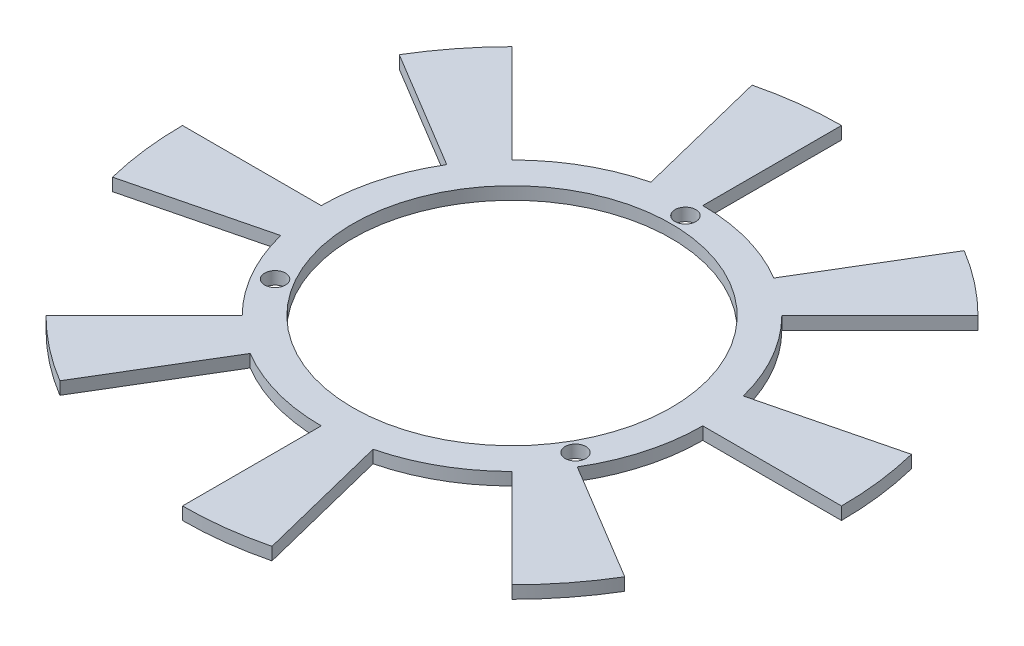
ISO-10303-21;
HEADER;
FILE_DESCRIPTION(('STEP AP214'),'2;1');
FILE_NAME('part.step','',(''),(''),'','','');
FILE_SCHEMA(('AUTOMOTIVE_DESIGN { 1 0 10303 214 1 1 1 1 }'));
ENDSEC;
DATA;
#1=APPLICATION_CONTEXT('core data for automotive mechanical design processes');
#2=APPLICATION_PROTOCOL_DEFINITION('international standard','automotive_design',2000,#1);
#3=PRODUCT_CONTEXT('',#1,'mechanical');
#4=PRODUCT('Part','Part','',(#3));
#5=PRODUCT_RELATED_PRODUCT_CATEGORY('part','',(#4));
#6=PRODUCT_DEFINITION_FORMATION('','',#4);
#7=PRODUCT_DEFINITION_CONTEXT('part definition',#1,'design');
#8=PRODUCT_DEFINITION('design','',#6,#7);
#9=PRODUCT_DEFINITION_SHAPE('','',#8);
#10=(LENGTH_UNIT() NAMED_UNIT(*) SI_UNIT(.MILLI.,.METRE.));
#11=(NAMED_UNIT(*) PLANE_ANGLE_UNIT() SI_UNIT($,.RADIAN.));
#12=(NAMED_UNIT(*) SI_UNIT($,.STERADIAN.) SOLID_ANGLE_UNIT());
#13=UNCERTAINTY_MEASURE_WITH_UNIT(LENGTH_MEASURE(1.E-05),#10,'distance_accuracy_value','');
#14=(GEOMETRIC_REPRESENTATION_CONTEXT(3) GLOBAL_UNCERTAINTY_ASSIGNED_CONTEXT((#13)) GLOBAL_UNIT_ASSIGNED_CONTEXT((#10,
#11,#12)) REPRESENTATION_CONTEXT('',''));
#15=CARTESIAN_POINT('',(0.,0.,0.));
#16=DIRECTION('',(0.,0.,1.));
#17=DIRECTION('',(1.,0.,0.));
#18=AXIS2_PLACEMENT_3D('',#15,#16,#17);
#19=CARTESIAN_POINT('',(0.,-2.,0.));
#20=DIRECTION('',(0.,1.,0.));
#21=DIRECTION('',(0.,0.,1.));
#22=AXIS2_PLACEMENT_3D('',#19,#20,#21);
#23=CYLINDRICAL_SURFACE('',#22,30.25);
#24=DIRECTION('',(0.,-1.,0.));
#25=VECTOR('',#24,1.);
#26=CARTESIAN_POINT('',(-15.5799017660291,0.,25.9293108462389));
#27=LINE('',#26,#25);
#28=CARTESIAN_POINT('',(-15.5799017660291,0.,25.9293108462389));
#29=VERTEX_POINT('',#28);
#30=CARTESIAN_POINT('',(-15.5799017660291,-2.,25.9293108462389));
#31=VERTEX_POINT('',#30);
#32=EDGE_CURVE('E286',#29,#31,#27,.T.);
#33=ORIENTED_EDGE('',*,*,#32,.T.);
#34=CARTESIAN_POINT('',(0.,-2.,0.));
#35=DIRECTION('',(0.,1.,0.));
#36=DIRECTION('',(1.,0.,0.));
#37=AXIS2_PLACEMENT_3D('',#34,#35,#36);
#38=CIRCLE('',#37,30.25);
#39=CARTESIAN_POINT('',(0.,-2.,30.25));
#40=VERTEX_POINT('',#39);
#41=EDGE_CURVE('E51',#31,#40,#38,.T.);
#42=ORIENTED_EDGE('',*,*,#41,.T.);
#43=DIRECTION('',(0.,-1.,0.));
#44=VECTOR('',#43,1.);
#45=CARTESIAN_POINT('',(0.,0.,30.25));
#46=LINE('',#45,#44);
#47=CARTESIAN_POINT('',(0.,0.,30.25));
#48=VERTEX_POINT('',#47);
#49=EDGE_CURVE('E442',#48,#40,#46,.T.);
#50=ORIENTED_EDGE('',*,*,#49,.F.);
#51=CARTESIAN_POINT('',(0.,0.,0.));
#52=DIRECTION('',(0.,1.,0.));
#53=DIRECTION('',(1.,0.,0.));
#54=AXIS2_PLACEMENT_3D('',#51,#52,#53);
#55=CIRCLE('',#54,30.25);
#56=EDGE_CURVE('E541',#29,#48,#55,.T.);
#57=ORIENTED_EDGE('',*,*,#56,.F.);
#58=EDGE_LOOP('',(#33,#42,#50,#57));
#59=FACE_BOUND('',#58,.T.);
#60=ADVANCED_FACE('F41',(#59),#23,.T.);
#61=DIRECTION('',(0.,-1.,0.));
#62=VECTOR('',#61,1.);
#63=CARTESIAN_POINT('',(-21.3899801308931,0.,21.3899801308931));
#64=LINE('',#63,#62);
#65=CARTESIAN_POINT('',(-21.3899801308931,0.,21.3899801308931));
#66=VERTEX_POINT('',#65);
#67=CARTESIAN_POINT('',(-21.3899801308931,-2.,21.3899801308931));
#68=VERTEX_POINT('',#67);
#69=EDGE_CURVE('E265',#66,#68,#64,.T.);
#70=ORIENTED_EDGE('',*,*,#69,.F.);
#71=CARTESIAN_POINT('',(-29.3514457198489,0.,7.31813734188998));
#72=VERTEX_POINT('',#71);
#73=EDGE_CURVE('E271',#72,#66,#55,.T.);
#74=ORIENTED_EDGE('',*,*,#73,.F.);
#75=DIRECTION('',(0.,-1.,0.));
#76=VECTOR('',#75,1.);
#77=CARTESIAN_POINT('',(-29.3514457198489,0.,7.31813734188998));
#78=LINE('',#77,#76);
#79=CARTESIAN_POINT('',(-29.3514457198489,-2.,7.31813734188998));
#80=VERTEX_POINT('',#79);
#81=EDGE_CURVE('E308',#72,#80,#78,.T.);
#82=ORIENTED_EDGE('',*,*,#81,.T.);
#83=EDGE_CURVE('E612',#80,#68,#38,.T.);
#84=ORIENTED_EDGE('',*,*,#83,.T.);
#85=EDGE_LOOP('',(#70,#74,#82,#84));
#86=FACE_BOUND('',#85,.T.);
#87=ADVANCED_FACE('F516',(#86),#23,.T.);
#88=DIRECTION('',(0.,-1.,0.));
#89=VECTOR('',#88,1.);
#90=CARTESIAN_POINT('',(-30.25,0.,0.));
#91=LINE('',#90,#89);
#92=CARTESIAN_POINT('',(-30.25,0.,0.));
#93=VERTEX_POINT('',#92);
#94=CARTESIAN_POINT('',(-30.25,-2.,0.));
#95=VERTEX_POINT('',#94);
#96=EDGE_CURVE('E311',#93,#95,#91,.T.);
#97=ORIENTED_EDGE('',*,*,#96,.F.);
#98=CARTESIAN_POINT('',(-25.9293108462389,0.,-15.5799017660291));
#99=VERTEX_POINT('',#98);
#100=EDGE_CURVE('E589',#99,#93,#55,.T.);
#101=ORIENTED_EDGE('',*,*,#100,.F.);
#102=DIRECTION('',(0.,-1.,0.));
#103=VECTOR('',#102,1.);
#104=CARTESIAN_POINT('',(-25.9293108462389,0.,-15.5799017660291));
#105=LINE('',#104,#103);
#106=CARTESIAN_POINT('',(-25.9293108462389,-2.,-15.5799017660291));
#107=VERTEX_POINT('',#106);
#108=EDGE_CURVE('E334',#99,#107,#105,.T.);
#109=ORIENTED_EDGE('',*,*,#108,.T.);
#110=EDGE_CURVE('E601',#107,#95,#38,.T.);
#111=ORIENTED_EDGE('',*,*,#110,.T.);
#112=EDGE_LOOP('',(#97,#101,#109,#111));
#113=FACE_BOUND('',#112,.T.);
#114=ADVANCED_FACE('F521',(#113),#23,.T.);
#115=DIRECTION('',(0.,-1.,0.));
#116=VECTOR('',#115,1.);
#117=CARTESIAN_POINT('',(-21.3899801308931,0.,-21.3899801308931));
#118=LINE('',#117,#116);
#119=CARTESIAN_POINT('',(-21.3899801308931,0.,-21.3899801308931));
#120=VERTEX_POINT('',#119);
#121=CARTESIAN_POINT('',(-21.3899801308931,-2.,-21.3899801308931));
#122=VERTEX_POINT('',#121);
#123=EDGE_CURVE('E337',#120,#122,#118,.T.);
#124=ORIENTED_EDGE('',*,*,#123,.F.);
#125=CARTESIAN_POINT('',(-7.31813734188998,0.,-29.3514457198489));
#126=VERTEX_POINT('',#125);
#127=EDGE_CURVE('E587',#126,#120,#55,.T.);
#128=ORIENTED_EDGE('',*,*,#127,.F.);
#129=DIRECTION('',(0.,-1.,0.));
#130=VECTOR('',#129,1.);
#131=CARTESIAN_POINT('',(-7.31813734188998,0.,-29.3514457198489));
#132=LINE('',#131,#130);
#133=CARTESIAN_POINT('',(-7.31813734188998,-2.,-29.3514457198489));
#134=VERTEX_POINT('',#133);
#135=EDGE_CURVE('E360',#126,#134,#132,.T.);
#136=ORIENTED_EDGE('',*,*,#135,.T.);
#137=EDGE_CURVE('E865',#134,#122,#38,.T.);
#138=ORIENTED_EDGE('',*,*,#137,.T.);
#139=EDGE_LOOP('',(#124,#128,#136,#138));
#140=FACE_BOUND('',#139,.T.);
#141=ADVANCED_FACE('F864',(#140),#23,.T.);
#142=DIRECTION('',(0.,-1.,0.));
#143=VECTOR('',#142,1.);
#144=CARTESIAN_POINT('',(0.,0.,-30.25));
#145=LINE('',#144,#143);
#146=CARTESIAN_POINT('',(0.,0.,-30.25));
#147=VERTEX_POINT('',#146);
#148=CARTESIAN_POINT('',(0.,-2.,-30.25));
#149=VERTEX_POINT('',#148);
#150=EDGE_CURVE('E363',#147,#149,#145,.T.);
#151=ORIENTED_EDGE('',*,*,#150,.F.);
#152=CARTESIAN_POINT('',(15.5799017660291,0.,-25.9293108462389));
#153=VERTEX_POINT('',#152);
#154=EDGE_CURVE('E543',#153,#147,#55,.T.);
#155=ORIENTED_EDGE('',*,*,#154,.F.);
#156=DIRECTION('',(0.,-1.,0.));
#157=VECTOR('',#156,1.);
#158=CARTESIAN_POINT('',(15.5799017660291,0.,-25.9293108462389));
#159=LINE('',#158,#157);
#160=CARTESIAN_POINT('',(15.5799017660291,-2.,-25.9293108462389));
#161=VERTEX_POINT('',#160);
#162=EDGE_CURVE('E386',#153,#161,#159,.T.);
#163=ORIENTED_EDGE('',*,*,#162,.T.);
#164=EDGE_CURVE('E867',#161,#149,#38,.T.);
#165=ORIENTED_EDGE('',*,*,#164,.T.);
#166=EDGE_LOOP('',(#151,#155,#163,#165));
#167=FACE_BOUND('',#166,.T.);
#168=ADVANCED_FACE('F872',(#167),#23,.T.);
#169=DIRECTION('',(0.,-1.,0.));
#170=VECTOR('',#169,1.);
#171=CARTESIAN_POINT('',(21.3899801308923,0.,-21.3899801308938));
#172=LINE('',#171,#170);
#173=CARTESIAN_POINT('',(21.3899801308923,0.,-21.3899801308938));
#174=VERTEX_POINT('',#173);
#175=CARTESIAN_POINT('',(21.3899801308923,-2.,-21.3899801308938));
#176=VERTEX_POINT('',#175);
#177=EDGE_CURVE('E389',#174,#176,#172,.T.);
#178=ORIENTED_EDGE('',*,*,#177,.F.);
#179=CARTESIAN_POINT('',(29.3514457198489,0.,-7.31813734188997));
#180=VERTEX_POINT('',#179);
#181=EDGE_CURVE('E540',#180,#174,#55,.T.);
#182=ORIENTED_EDGE('',*,*,#181,.F.);
#183=DIRECTION('',(0.,-1.,0.));
#184=VECTOR('',#183,1.);
#185=CARTESIAN_POINT('',(29.3514457198489,0.,-7.31813734188997));
#186=LINE('',#185,#184);
#187=CARTESIAN_POINT('',(29.3514457198489,-2.,-7.31813734188997));
#188=VERTEX_POINT('',#187);
#189=EDGE_CURVE('E412',#180,#188,#186,.T.);
#190=ORIENTED_EDGE('',*,*,#189,.T.);
#191=EDGE_CURVE('E50',#188,#176,#38,.T.);
#192=ORIENTED_EDGE('',*,*,#191,.T.);
#193=EDGE_LOOP('',(#178,#182,#190,#192));
#194=FACE_BOUND('',#193,.T.);
#195=ADVANCED_FACE('F529',(#194),#23,.T.);
#196=DIRECTION('',(0.,-1.,0.));
#197=VECTOR('',#196,1.);
#198=CARTESIAN_POINT('',(7.31813734188996,0.,29.3514457198489));
#199=LINE('',#198,#197);
#200=CARTESIAN_POINT('',(7.31813734188996,0.,29.3514457198489));
#201=VERTEX_POINT('',#200);
#202=CARTESIAN_POINT('',(7.31813734188996,-2.,29.3514457198489));
#203=VERTEX_POINT('',#202);
#204=EDGE_CURVE('E439',#201,#203,#199,.T.);
#205=ORIENTED_EDGE('',*,*,#204,.T.);
#206=CARTESIAN_POINT('',(21.3899801308937,-2.,21.3899801308924));
#207=VERTEX_POINT('',#206);
#208=EDGE_CURVE('E52',#203,#207,#38,.T.);
#209=ORIENTED_EDGE('',*,*,#208,.T.);
#210=DIRECTION('',(0.,-1.,0.));
#211=VECTOR('',#210,1.);
#212=CARTESIAN_POINT('',(21.3899801308937,0.,21.3899801308924));
#213=LINE('',#212,#211);
#214=CARTESIAN_POINT('',(21.3899801308937,0.,21.3899801308924));
#215=VERTEX_POINT('',#214);
#216=EDGE_CURVE('E470',#215,#207,#213,.T.);
#217=ORIENTED_EDGE('',*,*,#216,.F.);
#218=EDGE_CURVE('E495',#201,#215,#55,.T.);
#219=ORIENTED_EDGE('',*,*,#218,.F.);
#220=EDGE_LOOP('',(#205,#209,#217,#219));
#221=FACE_BOUND('',#220,.T.);
#222=ADVANCED_FACE('F524',(#221),#23,.T.);
#223=DIRECTION('',(0.,-1.,0.));
#224=VECTOR('',#223,1.);
#225=CARTESIAN_POINT('',(30.25,0.,-1.02522157430229E-12));
#226=LINE('',#225,#224);
#227=CARTESIAN_POINT('',(30.25,0.,-1.02522157430229E-12));
#228=VERTEX_POINT('',#227);
#229=CARTESIAN_POINT('',(30.25,-2.,-1.02522157430229E-12));
#230=VERTEX_POINT('',#229);
#231=EDGE_CURVE('E415',#228,#230,#226,.T.);
#232=ORIENTED_EDGE('',*,*,#231,.F.);
#233=CARTESIAN_POINT('',(25.9293108462389,0.,15.5799017660291));
#234=VERTEX_POINT('',#233);
#235=EDGE_CURVE('E45',#234,#228,#55,.T.);
#236=ORIENTED_EDGE('',*,*,#235,.F.);
#237=DIRECTION('',(0.,-1.,0.));
#238=VECTOR('',#237,1.);
#239=CARTESIAN_POINT('',(25.9293108462389,0.,15.5799017660291));
#240=LINE('',#239,#238);
#241=CARTESIAN_POINT('',(25.9293108462389,-2.,15.5799017660291));
#242=VERTEX_POINT('',#241);
#243=EDGE_CURVE('E467',#234,#242,#240,.T.);
#244=ORIENTED_EDGE('',*,*,#243,.T.);
#245=EDGE_CURVE('E12',#242,#230,#38,.T.);
#246=ORIENTED_EDGE('',*,*,#245,.T.);
#247=EDGE_LOOP('',(#232,#236,#244,#246));
#248=FACE_BOUND('',#247,.T.);
#249=ADVANCED_FACE('F43',(#248),#23,.T.);
#250=CARTESIAN_POINT('',(0.,-2.,0.));
#251=DIRECTION('',(0.,1.,0.));
#252=DIRECTION('',(0.,0.,1.));
#253=AXIS2_PLACEMENT_3D('',#250,#251,#252);
#254=PLANE('',#253);
#255=CARTESIAN_POINT('',(0.,-2.,-27.5));
#256=DIRECTION('',(0.,1.,0.));
#257=DIRECTION('',(0.,0.,1.));
#258=AXIS2_PLACEMENT_3D('',#255,#256,#257);
#259=CIRCLE('',#258,1.65);
#260=CARTESIAN_POINT('',(0.,-2.,-25.85));
#261=VERTEX_POINT('',#260);
#262=EDGE_CURVE('E488',#261,#261,#259,.T.);
#263=ORIENTED_EDGE('',*,*,#262,.T.);
#264=EDGE_LOOP('',(#263));
#265=FACE_BOUND('',#264,.T.);
#266=CARTESIAN_POINT('',(23.815698604072,-2.,13.7500000000001));
#267=DIRECTION('',(0.,1.,0.));
#268=DIRECTION('',(0.,0.,1.));
#269=AXIS2_PLACEMENT_3D('',#266,#267,#268);
#270=CIRCLE('',#269,1.65);
#271=CARTESIAN_POINT('',(23.815698604072,-2.,15.4000000000001));
#272=VERTEX_POINT('',#271);
#273=EDGE_CURVE('E485',#272,#272,#270,.T.);
#274=ORIENTED_EDGE('',*,*,#273,.T.);
#275=EDGE_LOOP('',(#274));
#276=FACE_BOUND('',#275,.T.);
#277=CARTESIAN_POINT('',(-23.815698604072,-2.,13.7500000000001));
#278=DIRECTION('',(0.,1.,0.));
#279=DIRECTION('',(0.,0.,1.));
#280=AXIS2_PLACEMENT_3D('',#277,#278,#279);
#281=CIRCLE('',#280,1.65);
#282=CARTESIAN_POINT('',(-23.815698604072,-2.,15.4000000000001));
#283=VERTEX_POINT('',#282);
#284=EDGE_CURVE('E477',#283,#283,#281,.T.);
#285=ORIENTED_EDGE('',*,*,#284,.T.);
#286=EDGE_LOOP('',(#285));
#287=FACE_BOUND('',#286,.T.);
#288=CARTESIAN_POINT('',(0.,-2.,0.));
#289=DIRECTION('',(0.,1.,0.));
#290=DIRECTION('',(0.,0.,1.));
#291=AXIS2_PLACEMENT_3D('',#288,#289,#290);
#292=CIRCLE('',#291,25.25);
#293=CARTESIAN_POINT('',(0.,-2.,25.25));
#294=VERTEX_POINT('',#293);
#295=EDGE_CURVE('E492',#294,#294,#292,.T.);
#296=ORIENTED_EDGE('',*,*,#295,.T.);
#297=EDGE_LOOP('',(#296));
#298=FACE_BOUND('',#297,.T.);
#299=ORIENTED_EDGE('',*,*,#245,.F.);
#300=DIRECTION('',(0.857167300702112,0.,0.515038074910054));
#301=VECTOR('',#300,1.);
#302=CARTESIAN_POINT('',(25.9293108462389,-2.,15.5799017660291));
#303=LINE('',#302,#301);
#304=CARTESIAN_POINT('',(44.7869914616854,-2.,26.9107394140503));
#305=VERTEX_POINT('',#304);
#306=EDGE_CURVE('E450',#242,#305,#303,.T.);
#307=ORIENTED_EDGE('',*,*,#306,.T.);
#308=CARTESIAN_POINT('',(0.,-2.,0.));
#309=DIRECTION('',(0.,-1.,0.));
#310=DIRECTION('',(0.,0.,-1.));
#311=AXIS2_PLACEMENT_3D('',#308,#309,#310);
#312=CIRCLE('',#311,52.25);
#313=CARTESIAN_POINT('',(36.9463293169977,-2.,36.9463293169965));
#314=VERTEX_POINT('',#313);
#315=EDGE_CURVE('E438',#305,#314,#312,.T.);
#316=ORIENTED_EDGE('',*,*,#315,.T.);
#317=DIRECTION('',(-0.707106781186544,0.,-0.707106781186551));
#318=VECTOR('',#317,1.);
#319=CARTESIAN_POINT('',(36.9463293169977,-2.,36.9463293169965));
#320=LINE('',#319,#318);
#321=EDGE_CURVE('E459',#314,#207,#320,.T.);
#322=ORIENTED_EDGE('',*,*,#321,.T.);
#323=ORIENTED_EDGE('',*,*,#208,.F.);
#324=DIRECTION('',(0.241921895599668,0.,0.970295726275996));
#325=VECTOR('',#324,1.);
#326=CARTESIAN_POINT('',(7.31813734188997,-2.,29.3514457198489));
#327=LINE('',#326,#325);
#328=CARTESIAN_POINT('',(12.6404190450827,-2.,50.6979516979208));
#329=VERTEX_POINT('',#328);
#330=EDGE_CURVE('E422',#203,#329,#327,.T.);
#331=ORIENTED_EDGE('',*,*,#330,.T.);
#332=CARTESIAN_POINT('',(0.,-2.,0.));
#333=DIRECTION('',(0.,-1.,0.));
#334=DIRECTION('',(0.,0.,-1.));
#335=AXIS2_PLACEMENT_3D('',#332,#333,#334);
#336=CIRCLE('',#335,52.25);
#337=CARTESIAN_POINT('',(0.,-2.,52.25));
#338=VERTEX_POINT('',#337);
#339=EDGE_CURVE('E411',#329,#338,#336,.T.);
#340=ORIENTED_EDGE('',*,*,#339,.T.);
#341=DIRECTION('',(0.,0.,-1.));
#342=VECTOR('',#341,1.);
#343=CARTESIAN_POINT('',(0.,-2.,52.25));
#344=LINE('',#343,#342);
#345=EDGE_CURVE('E431',#338,#40,#344,.T.);
#346=ORIENTED_EDGE('',*,*,#345,.T.);
#347=ORIENTED_EDGE('',*,*,#41,.F.);
#348=DIRECTION('',(-0.515038074910054,0.,0.857167300702113));
#349=VECTOR('',#348,1.);
#350=CARTESIAN_POINT('',(-15.5799017660291,-2.,25.9293108462389));
#351=LINE('',#350,#349);
#352=CARTESIAN_POINT('',(-26.9107394140503,-2.,44.7869914616854));
#353=VERTEX_POINT('',#352);
#354=EDGE_CURVE('E275',#31,#353,#351,.T.);
#355=ORIENTED_EDGE('',*,*,#354,.T.);
#356=CARTESIAN_POINT('',(0.,-2.,0.));
#357=DIRECTION('',(0.,-1.,0.));
#358=DIRECTION('',(0.,0.,-1.));
#359=AXIS2_PLACEMENT_3D('',#356,#357,#358);
#360=CIRCLE('',#359,52.25);
#361=CARTESIAN_POINT('',(-36.9463293169971,-2.,36.9463293169971));
#362=VERTEX_POINT('',#361);
#363=EDGE_CURVE('E281',#353,#362,#360,.T.);
#364=ORIENTED_EDGE('',*,*,#363,.T.);
#365=DIRECTION('',(0.707106781186548,0.,-0.707106781186548));
#366=VECTOR('',#365,1.);
#367=CARTESIAN_POINT('',(-36.9463293169971,-2.,36.9463293169971));
#368=LINE('',#367,#366);
#369=EDGE_CURVE('E260',#362,#68,#368,.T.);
#370=ORIENTED_EDGE('',*,*,#369,.T.);
#371=ORIENTED_EDGE('',*,*,#83,.F.);
#372=DIRECTION('',(-0.970295726275996,0.,0.241921895599668));
#373=VECTOR('',#372,1.);
#374=CARTESIAN_POINT('',(-29.3514457198489,-2.,7.31813734188996));
#375=LINE('',#374,#373);
#376=CARTESIAN_POINT('',(-50.6979516979208,-2.,12.6404190450827));
#377=VERTEX_POINT('',#376);
#378=EDGE_CURVE('E294',#80,#377,#375,.T.);
#379=ORIENTED_EDGE('',*,*,#378,.T.);
#380=CARTESIAN_POINT('',(0.,-2.,0.));
#381=DIRECTION('',(0.,-1.,0.));
#382=DIRECTION('',(0.,0.,-1.));
#383=AXIS2_PLACEMENT_3D('',#380,#381,#382);
#384=CIRCLE('',#383,52.25);
#385=CARTESIAN_POINT('',(-52.25,-2.,0.));
#386=VERTEX_POINT('',#385);
#387=EDGE_CURVE('E285',#377,#386,#384,.T.);
#388=ORIENTED_EDGE('',*,*,#387,.T.);
#389=DIRECTION('',(1.,0.,0.));
#390=VECTOR('',#389,1.);
#391=CARTESIAN_POINT('',(-52.25,-2.,0.));
#392=LINE('',#391,#390);
#393=EDGE_CURVE('E300',#386,#95,#392,.T.);
#394=ORIENTED_EDGE('',*,*,#393,.T.);
#395=ORIENTED_EDGE('',*,*,#110,.F.);
#396=DIRECTION('',(-0.857167300702113,0.,-0.515038074910054));
#397=VECTOR('',#396,1.);
#398=CARTESIAN_POINT('',(-25.9293108462389,-2.,-15.5799017660291));
#399=LINE('',#398,#397);
#400=CARTESIAN_POINT('',(-44.7869914616854,-2.,-26.9107394140503));
#401=VERTEX_POINT('',#400);
#402=EDGE_CURVE('E318',#107,#401,#399,.T.);
#403=ORIENTED_EDGE('',*,*,#402,.T.);
#404=CARTESIAN_POINT('',(0.,-2.,0.));
#405=DIRECTION('',(0.,-1.,0.));
#406=DIRECTION('',(0.,0.,-1.));
#407=AXIS2_PLACEMENT_3D('',#404,#405,#406);
#408=CIRCLE('',#407,52.25);
#409=CARTESIAN_POINT('',(-36.9463293169971,-2.,-36.9463293169971));
#410=VERTEX_POINT('',#409);
#411=EDGE_CURVE('E307',#401,#410,#408,.T.);
#412=ORIENTED_EDGE('',*,*,#411,.T.);
#413=DIRECTION('',(0.707106781186548,0.,0.707106781186548));
#414=VECTOR('',#413,1.);
#415=CARTESIAN_POINT('',(-36.9463293169971,-2.,-36.9463293169971));
#416=LINE('',#415,#414);
#417=EDGE_CURVE('E326',#410,#122,#416,.T.);
#418=ORIENTED_EDGE('',*,*,#417,.T.);
#419=ORIENTED_EDGE('',*,*,#137,.F.);
#420=DIRECTION('',(-0.241921895599668,0.,-0.970295726275996));
#421=VECTOR('',#420,1.);
#422=CARTESIAN_POINT('',(-7.31813734188996,-2.,-29.3514457198489));
#423=LINE('',#422,#421);
#424=CARTESIAN_POINT('',(-12.6404190450827,-2.,-50.6979516979208));
#425=VERTEX_POINT('',#424);
#426=EDGE_CURVE('E344',#134,#425,#423,.T.);
#427=ORIENTED_EDGE('',*,*,#426,.T.);
#428=CARTESIAN_POINT('',(0.,-2.,0.));
#429=DIRECTION('',(0.,-1.,0.));
#430=DIRECTION('',(0.,0.,-1.));
#431=AXIS2_PLACEMENT_3D('',#428,#429,#430);
#432=CIRCLE('',#431,52.25);
#433=CARTESIAN_POINT('',(-1.09894732203131E-12,-2.,-52.25));
#434=VERTEX_POINT('',#433);
#435=EDGE_CURVE('E333',#425,#434,#432,.T.);
#436=ORIENTED_EDGE('',*,*,#435,.T.);
#437=DIRECTION('',(0.,0.,1.));
#438=VECTOR('',#437,1.);
#439=CARTESIAN_POINT('',(-1.09894732203131E-12,-2.,-52.25));
#440=LINE('',#439,#438);
#441=EDGE_CURVE('E352',#434,#149,#440,.T.);
#442=ORIENTED_EDGE('',*,*,#441,.T.);
#443=ORIENTED_EDGE('',*,*,#164,.F.);
#444=DIRECTION('',(0.515038074910054,0.,-0.857167300702112));
#445=VECTOR('',#444,1.);
#446=CARTESIAN_POINT('',(15.5799017660291,-2.,-25.9293108462389));
#447=LINE('',#446,#445);
#448=CARTESIAN_POINT('',(26.9107394140503,-2.,-44.7869914616854));
#449=VERTEX_POINT('',#448);
#450=EDGE_CURVE('E370',#161,#449,#447,.T.);
#451=ORIENTED_EDGE('',*,*,#450,.T.);
#452=CARTESIAN_POINT('',(0.,-2.,0.));
#453=DIRECTION('',(0.,-1.,0.));
#454=DIRECTION('',(0.,0.,-1.));
#455=AXIS2_PLACEMENT_3D('',#452,#453,#454);
#456=CIRCLE('',#455,52.25);
#457=CARTESIAN_POINT('',(36.9463293169964,-2.,-36.9463293169978));
#458=VERTEX_POINT('',#457);
#459=EDGE_CURVE('E359',#449,#458,#456,.T.);
#460=ORIENTED_EDGE('',*,*,#459,.T.);
#461=DIRECTION('',(-0.70710678118655,0.,0.707106781186545));
#462=VECTOR('',#461,1.);
#463=CARTESIAN_POINT('',(36.9463293169964,-2.,-36.9463293169978));
#464=LINE('',#463,#462);
#465=EDGE_CURVE('E378',#458,#176,#464,.T.);
#466=ORIENTED_EDGE('',*,*,#465,.T.);
#467=ORIENTED_EDGE('',*,*,#191,.F.);
#468=DIRECTION('',(0.970295726275996,0.,-0.241921895599668));
#469=VECTOR('',#468,1.);
#470=CARTESIAN_POINT('',(29.3514457198489,-2.,-7.31813734188997));
#471=LINE('',#470,#469);
#472=CARTESIAN_POINT('',(50.6979516979208,-2.,-12.6404190450827));
#473=VERTEX_POINT('',#472);
#474=EDGE_CURVE('E396',#188,#473,#471,.T.);
#475=ORIENTED_EDGE('',*,*,#474,.T.);
#476=CARTESIAN_POINT('',(0.,-2.,0.));
#477=DIRECTION('',(0.,-1.,0.));
#478=DIRECTION('',(0.,0.,-1.));
#479=AXIS2_PLACEMENT_3D('',#476,#477,#478);
#480=CIRCLE('',#479,52.25);
#481=CARTESIAN_POINT('',(52.25,-2.,-9.33281230075522E-13));
#482=VERTEX_POINT('',#481);
#483=EDGE_CURVE('E385',#473,#482,#480,.T.);
#484=ORIENTED_EDGE('',*,*,#483,.T.);
#485=DIRECTION('',(-1.,0.,0.));
#486=VECTOR('',#485,1.);
#487=CARTESIAN_POINT('',(52.25,-2.,-9.33281230075522E-13));
#488=LINE('',#487,#486);
#489=EDGE_CURVE('E404',#482,#230,#488,.T.);
#490=ORIENTED_EDGE('',*,*,#489,.T.);
#491=EDGE_LOOP('',(#299,#307,#316,#322,#323,#331,#340,#346,#347,#355,#364,#370,#371,#379,#388,
#394,#395,#403,#412,#418,#419,#427,#436,#442,#443,#451,#460,#466,#467,#475,#484,#490));
#492=FACE_BOUND('',#491,.T.);
#493=ADVANCED_FACE('F502',(#265,#276,#287,#298,#492),#254,.F.);
#494=CARTESIAN_POINT('',(0.,0.,0.));
#495=DIRECTION('',(0.,1.,0.));
#496=DIRECTION('',(0.,0.,1.));
#497=AXIS2_PLACEMENT_3D('',#494,#495,#496);
#498=PLANE('',#497);
#499=CARTESIAN_POINT('',(0.,0.,-27.5));
#500=DIRECTION('',(0.,1.,0.));
#501=DIRECTION('',(0.,0.,1.));
#502=AXIS2_PLACEMENT_3D('',#499,#500,#501);
#503=CIRCLE('',#502,1.65);
#504=CARTESIAN_POINT('',(0.,0.,-25.85));
#505=VERTEX_POINT('',#504);
#506=EDGE_CURVE('E474',#505,#505,#503,.T.);
#507=ORIENTED_EDGE('',*,*,#506,.F.);
#508=EDGE_LOOP('',(#507));
#509=FACE_BOUND('',#508,.T.);
#510=CARTESIAN_POINT('',(23.815698604072,0.,13.7500000000001));
#511=DIRECTION('',(0.,1.,0.));
#512=DIRECTION('',(0.,0.,1.));
#513=AXIS2_PLACEMENT_3D('',#510,#511,#512);
#514=CIRCLE('',#513,1.65);
#515=CARTESIAN_POINT('',(23.815698604072,0.,15.4000000000001));
#516=VERTEX_POINT('',#515);
#517=EDGE_CURVE('E478',#516,#516,#514,.T.);
#518=ORIENTED_EDGE('',*,*,#517,.F.);
#519=EDGE_LOOP('',(#518));
#520=FACE_BOUND('',#519,.T.);
#521=CARTESIAN_POINT('',(-23.815698604072,0.,13.7500000000001));
#522=DIRECTION('',(0.,1.,0.));
#523=DIRECTION('',(0.,0.,1.));
#524=AXIS2_PLACEMENT_3D('',#521,#522,#523);
#525=CIRCLE('',#524,1.65);
#526=CARTESIAN_POINT('',(-23.815698604072,0.,15.4000000000001));
#527=VERTEX_POINT('',#526);
#528=EDGE_CURVE('E466',#527,#527,#525,.T.);
#529=ORIENTED_EDGE('',*,*,#528,.F.);
#530=EDGE_LOOP('',(#529));
#531=FACE_BOUND('',#530,.T.);
#532=CARTESIAN_POINT('',(0.,0.,0.));
#533=DIRECTION('',(0.,1.,0.));
#534=DIRECTION('',(0.,0.,1.));
#535=AXIS2_PLACEMENT_3D('',#532,#533,#534);
#536=CIRCLE('',#535,25.25);
#537=CARTESIAN_POINT('',(0.,0.,25.25));
#538=VERTEX_POINT('',#537);
#539=EDGE_CURVE('E491',#538,#538,#536,.T.);
#540=ORIENTED_EDGE('',*,*,#539,.F.);
#541=EDGE_LOOP('',(#540));
#542=FACE_BOUND('',#541,.T.);
#543=ORIENTED_EDGE('',*,*,#235,.T.);
#544=DIRECTION('',(-1.,0.,0.));
#545=VECTOR('',#544,1.);
#546=CARTESIAN_POINT('',(52.25,0.,-9.33281230075522E-13));
#547=LINE('',#546,#545);
#548=CARTESIAN_POINT('',(52.25,0.,-9.33281230075522E-13));
#549=VERTEX_POINT('',#548);
#550=EDGE_CURVE('E395',#549,#228,#547,.T.);
#551=ORIENTED_EDGE('',*,*,#550,.F.);
#552=CARTESIAN_POINT('',(0.,0.,0.));
#553=DIRECTION('',(0.,-1.,0.));
#554=DIRECTION('',(0.,0.,-1.));
#555=AXIS2_PLACEMENT_3D('',#552,#553,#554);
#556=CIRCLE('',#555,52.25);
#557=CARTESIAN_POINT('',(50.6979516979208,0.,-12.6404190450827));
#558=VERTEX_POINT('',#557);
#559=EDGE_CURVE('E392',#558,#549,#556,.T.);
#560=ORIENTED_EDGE('',*,*,#559,.F.);
#561=DIRECTION('',(0.970295726275996,0.,-0.241921895599668));
#562=VECTOR('',#561,1.);
#563=CARTESIAN_POINT('',(29.3514457198489,0.,-7.31813734188997));
#564=LINE('',#563,#562);
#565=EDGE_CURVE('E398',#180,#558,#564,.T.);
#566=ORIENTED_EDGE('',*,*,#565,.F.);
#567=ORIENTED_EDGE('',*,*,#181,.T.);
#568=DIRECTION('',(-0.70710678118655,0.,0.707106781186545));
#569=VECTOR('',#568,1.);
#570=CARTESIAN_POINT('',(36.9463293169964,0.,-36.9463293169978));
#571=LINE('',#570,#569);
#572=CARTESIAN_POINT('',(36.9463293169964,0.,-36.9463293169978));
#573=VERTEX_POINT('',#572);
#574=EDGE_CURVE('E369',#573,#174,#571,.T.);
#575=ORIENTED_EDGE('',*,*,#574,.F.);
#576=CARTESIAN_POINT('',(0.,0.,0.));
#577=DIRECTION('',(0.,-1.,0.));
#578=DIRECTION('',(0.,0.,-1.));
#579=AXIS2_PLACEMENT_3D('',#576,#577,#578);
#580=CIRCLE('',#579,52.25);
#581=CARTESIAN_POINT('',(26.9107394140503,0.,-44.7869914616854));
#582=VERTEX_POINT('',#581);
#583=EDGE_CURVE('E366',#582,#573,#580,.T.);
#584=ORIENTED_EDGE('',*,*,#583,.F.);
#585=DIRECTION('',(0.515038074910054,0.,-0.857167300702112));
#586=VECTOR('',#585,1.);
#587=CARTESIAN_POINT('',(15.5799017660291,0.,-25.9293108462389));
#588=LINE('',#587,#586);
#589=EDGE_CURVE('E372',#153,#582,#588,.T.);
#590=ORIENTED_EDGE('',*,*,#589,.F.);
#591=ORIENTED_EDGE('',*,*,#154,.T.);
#592=DIRECTION('',(0.,0.,1.));
#593=VECTOR('',#592,1.);
#594=CARTESIAN_POINT('',(-1.09894732203131E-12,0.,-52.25));
#595=LINE('',#594,#593);
#596=CARTESIAN_POINT('',(-1.09894732203131E-12,0.,-52.25));
#597=VERTEX_POINT('',#596);
#598=EDGE_CURVE('E343',#597,#147,#595,.T.);
#599=ORIENTED_EDGE('',*,*,#598,.F.);
#600=CARTESIAN_POINT('',(0.,0.,0.));
#601=DIRECTION('',(0.,-1.,0.));
#602=DIRECTION('',(0.,0.,-1.));
#603=AXIS2_PLACEMENT_3D('',#600,#601,#602);
#604=CIRCLE('',#603,52.25);
#605=CARTESIAN_POINT('',(-12.6404190450827,0.,-50.6979516979208));
#606=VERTEX_POINT('',#605);
#607=EDGE_CURVE('E340',#606,#597,#604,.T.);
#608=ORIENTED_EDGE('',*,*,#607,.F.);
#609=DIRECTION('',(-0.241921895599668,0.,-0.970295726275996));
#610=VECTOR('',#609,1.);
#611=CARTESIAN_POINT('',(-7.31813734188996,0.,-29.3514457198489));
#612=LINE('',#611,#610);
#613=EDGE_CURVE('E346',#126,#606,#612,.T.);
#614=ORIENTED_EDGE('',*,*,#613,.F.);
#615=ORIENTED_EDGE('',*,*,#127,.T.);
#616=DIRECTION('',(0.707106781186548,0.,0.707106781186548));
#617=VECTOR('',#616,1.);
#618=CARTESIAN_POINT('',(-36.9463293169971,0.,-36.9463293169971));
#619=LINE('',#618,#617);
#620=CARTESIAN_POINT('',(-36.9463293169971,0.,-36.9463293169971));
#621=VERTEX_POINT('',#620);
#622=EDGE_CURVE('E317',#621,#120,#619,.T.);
#623=ORIENTED_EDGE('',*,*,#622,.F.);
#624=CARTESIAN_POINT('',(0.,0.,0.));
#625=DIRECTION('',(0.,-1.,0.));
#626=DIRECTION('',(0.,0.,-1.));
#627=AXIS2_PLACEMENT_3D('',#624,#625,#626);
#628=CIRCLE('',#627,52.25);
#629=CARTESIAN_POINT('',(-44.7869914616854,0.,-26.9107394140503));
#630=VERTEX_POINT('',#629);
#631=EDGE_CURVE('E314',#630,#621,#628,.T.);
#632=ORIENTED_EDGE('',*,*,#631,.F.);
#633=DIRECTION('',(-0.857167300702113,0.,-0.515038074910054));
#634=VECTOR('',#633,1.);
#635=CARTESIAN_POINT('',(-25.9293108462389,0.,-15.5799017660291));
#636=LINE('',#635,#634);
#637=EDGE_CURVE('E320',#99,#630,#636,.T.);
#638=ORIENTED_EDGE('',*,*,#637,.F.);
#639=ORIENTED_EDGE('',*,*,#100,.T.);
#640=DIRECTION('',(1.,0.,0.));
#641=VECTOR('',#640,1.);
#642=CARTESIAN_POINT('',(-52.25,0.,0.));
#643=LINE('',#642,#641);
#644=CARTESIAN_POINT('',(-52.25,0.,0.));
#645=VERTEX_POINT('',#644);
#646=EDGE_CURVE('E293',#645,#93,#643,.T.);
#647=ORIENTED_EDGE('',*,*,#646,.F.);
#648=CARTESIAN_POINT('',(0.,0.,0.));
#649=DIRECTION('',(0.,-1.,0.));
#650=DIRECTION('',(0.,0.,-1.));
#651=AXIS2_PLACEMENT_3D('',#648,#649,#650);
#652=CIRCLE('',#651,52.25);
#653=CARTESIAN_POINT('',(-50.6979516979208,0.,12.6404190450827));
#654=VERTEX_POINT('',#653);
#655=EDGE_CURVE('E290',#654,#645,#652,.T.);
#656=ORIENTED_EDGE('',*,*,#655,.F.);
#657=DIRECTION('',(-0.970295726275996,0.,0.241921895599668));
#658=VECTOR('',#657,1.);
#659=CARTESIAN_POINT('',(-29.3514457198489,0.,7.31813734188996));
#660=LINE('',#659,#658);
#661=EDGE_CURVE('E66',#72,#654,#660,.T.);
#662=ORIENTED_EDGE('',*,*,#661,.F.);
#663=ORIENTED_EDGE('',*,*,#73,.T.);
#664=DIRECTION('',(0.707106781186548,0.,-0.707106781186548));
#665=VECTOR('',#664,1.);
#666=CARTESIAN_POINT('',(-36.9463293169971,0.,36.9463293169971));
#667=LINE('',#666,#665);
#668=CARTESIAN_POINT('',(-36.9463293169971,0.,36.9463293169971));
#669=VERTEX_POINT('',#668);
#670=EDGE_CURVE('E257',#669,#66,#667,.T.);
#671=ORIENTED_EDGE('',*,*,#670,.F.);
#672=CARTESIAN_POINT('',(0.,0.,0.));
#673=DIRECTION('',(0.,-1.,0.));
#674=DIRECTION('',(0.,0.,-1.));
#675=AXIS2_PLACEMENT_3D('',#672,#673,#674);
#676=CIRCLE('',#675,52.25);
#677=CARTESIAN_POINT('',(-26.9107394140503,0.,44.7869914616854));
#678=VERTEX_POINT('',#677);
#679=EDGE_CURVE('E269',#678,#669,#676,.T.);
#680=ORIENTED_EDGE('',*,*,#679,.F.);
#681=DIRECTION('',(-0.515038074910054,0.,0.857167300702113));
#682=VECTOR('',#681,1.);
#683=CARTESIAN_POINT('',(-15.5799017660291,0.,25.9293108462389));
#684=LINE('',#683,#682);
#685=EDGE_CURVE('E59',#29,#678,#684,.T.);
#686=ORIENTED_EDGE('',*,*,#685,.F.);
#687=ORIENTED_EDGE('',*,*,#56,.T.);
#688=DIRECTION('',(0.,0.,-1.));
#689=VECTOR('',#688,1.);
#690=CARTESIAN_POINT('',(0.,0.,52.25));
#691=LINE('',#690,#689);
#692=CARTESIAN_POINT('',(0.,0.,52.25));
#693=VERTEX_POINT('',#692);
#694=EDGE_CURVE('E421',#693,#48,#691,.T.);
#695=ORIENTED_EDGE('',*,*,#694,.F.);
#696=CARTESIAN_POINT('',(0.,0.,0.));
#697=DIRECTION('',(0.,-1.,0.));
#698=DIRECTION('',(0.,0.,-1.));
#699=AXIS2_PLACEMENT_3D('',#696,#697,#698);
#700=CIRCLE('',#699,52.25);
#701=CARTESIAN_POINT('',(12.6404190450827,0.,50.6979516979208));
#702=VERTEX_POINT('',#701);
#703=EDGE_CURVE('E418',#702,#693,#700,.T.);
#704=ORIENTED_EDGE('',*,*,#703,.F.);
#705=DIRECTION('',(0.241921895599668,0.,0.970295726275996));
#706=VECTOR('',#705,1.);
#707=CARTESIAN_POINT('',(7.31813734188997,0.,29.3514457198489));
#708=LINE('',#707,#706);
#709=EDGE_CURVE('E425',#201,#702,#708,.T.);
#710=ORIENTED_EDGE('',*,*,#709,.F.);
#711=ORIENTED_EDGE('',*,*,#218,.T.);
#712=DIRECTION('',(-0.707106781186544,0.,-0.707106781186551));
#713=VECTOR('',#712,1.);
#714=CARTESIAN_POINT('',(36.9463293169977,0.,36.9463293169965));
#715=LINE('',#714,#713);
#716=CARTESIAN_POINT('',(36.9463293169977,0.,36.9463293169965));
#717=VERTEX_POINT('',#716);
#718=EDGE_CURVE('E449',#717,#215,#715,.T.);
#719=ORIENTED_EDGE('',*,*,#718,.F.);
#720=CARTESIAN_POINT('',(0.,0.,0.));
#721=DIRECTION('',(0.,-1.,0.));
#722=DIRECTION('',(0.,0.,-1.));
#723=AXIS2_PLACEMENT_3D('',#720,#721,#722);
#724=CIRCLE('',#723,52.25);
#725=CARTESIAN_POINT('',(44.7869914616854,0.,26.9107394140503));
#726=VERTEX_POINT('',#725);
#727=EDGE_CURVE('E446',#726,#717,#724,.T.);
#728=ORIENTED_EDGE('',*,*,#727,.F.);
#729=DIRECTION('',(0.857167300702112,0.,0.515038074910054));
#730=VECTOR('',#729,1.);
#731=CARTESIAN_POINT('',(25.9293108462389,0.,15.5799017660291));
#732=LINE('',#731,#730);
#733=EDGE_CURVE('E453',#234,#726,#732,.T.);
#734=ORIENTED_EDGE('',*,*,#733,.F.);
#735=EDGE_LOOP('',(#543,#551,#560,#566,#567,#575,#584,#590,#591,#599,#608,#614,#615,#623,#632,
#638,#639,#647,#656,#662,#663,#671,#680,#686,#687,#695,#704,#710,#711,#719,#728,#734));
#736=FACE_BOUND('',#735,.T.);
#737=ADVANCED_FACE('F268',(#509,#520,#531,#542,#736),#498,.T.);
#738=CARTESIAN_POINT('',(0.,-2.,0.));
#739=DIRECTION('',(0.,1.,0.));
#740=DIRECTION('',(0.,0.,1.));
#741=AXIS2_PLACEMENT_3D('',#738,#739,#740);
#742=CYLINDRICAL_SURFACE('',#741,25.25);
#743=ORIENTED_EDGE('',*,*,#295,.F.);
#744=EDGE_LOOP('',(#743));
#745=FACE_BOUND('',#744,.T.);
#746=ORIENTED_EDGE('',*,*,#539,.T.);
#747=EDGE_LOOP('',(#746));
#748=FACE_BOUND('',#747,.T.);
#749=ADVANCED_FACE('F499',(#745,#748),#742,.F.);
#750=CARTESIAN_POINT('',(-23.815698604072,-10.,13.7500000000001));
#751=DIRECTION('',(0.,1.,0.));
#752=DIRECTION('',(0.,0.,1.));
#753=AXIS2_PLACEMENT_3D('',#750,#751,#752);
#754=CYLINDRICAL_SURFACE('',#753,1.65);
#755=ORIENTED_EDGE('',*,*,#528,.T.);
#756=EDGE_LOOP('',(#755));
#757=FACE_BOUND('',#756,.T.);
#758=ORIENTED_EDGE('',*,*,#284,.F.);
#759=EDGE_LOOP('',(#758));
#760=FACE_BOUND('',#759,.T.);
#761=ADVANCED_FACE('F508',(#757,#760),#754,.F.);
#762=CARTESIAN_POINT('',(23.815698604072,-10.,13.7500000000001));
#763=DIRECTION('',(0.,1.,0.));
#764=DIRECTION('',(0.,0.,1.));
#765=AXIS2_PLACEMENT_3D('',#762,#763,#764);
#766=CYLINDRICAL_SURFACE('',#765,1.65);
#767=ORIENTED_EDGE('',*,*,#517,.T.);
#768=EDGE_LOOP('',(#767));
#769=FACE_BOUND('',#768,.T.);
#770=ORIENTED_EDGE('',*,*,#273,.F.);
#771=EDGE_LOOP('',(#770));
#772=FACE_BOUND('',#771,.T.);
#773=ADVANCED_FACE('F647',(#769,#772),#766,.F.);
#774=CARTESIAN_POINT('',(0.,-10.,-27.5));
#775=DIRECTION('',(0.,1.,0.));
#776=DIRECTION('',(0.,0.,1.));
#777=AXIS2_PLACEMENT_3D('',#774,#775,#776);
#778=CYLINDRICAL_SURFACE('',#777,1.65);
#779=ORIENTED_EDGE('',*,*,#506,.T.);
#780=EDGE_LOOP('',(#779));
#781=FACE_BOUND('',#780,.T.);
#782=ORIENTED_EDGE('',*,*,#262,.F.);
#783=EDGE_LOOP('',(#782));
#784=FACE_BOUND('',#783,.T.);
#785=ADVANCED_FACE('F644',(#781,#784),#778,.F.);
#786=CARTESIAN_POINT('',(0.,0.,0.));
#787=DIRECTION('',(0.,-1.,0.));
#788=DIRECTION('',(0.,0.,-1.));
#789=AXIS2_PLACEMENT_3D('',#786,#787,#788);
#790=CYLINDRICAL_SURFACE('',#789,52.25);
#791=ORIENTED_EDGE('',*,*,#315,.F.);
#792=DIRECTION('',(0.,-1.,0.));
#793=VECTOR('',#792,1.);
#794=CARTESIAN_POINT('',(44.7869914616854,0.,26.9107394140503));
#795=LINE('',#794,#793);
#796=EDGE_CURVE('E464',#726,#305,#795,.T.);
#797=ORIENTED_EDGE('',*,*,#796,.F.);
#798=ORIENTED_EDGE('',*,*,#727,.T.);
#799=DIRECTION('',(0.,-1.,0.));
#800=VECTOR('',#799,1.);
#801=CARTESIAN_POINT('',(36.9463293169977,0.,36.9463293169965));
#802=LINE('',#801,#800);
#803=EDGE_CURVE('E456',#717,#314,#802,.T.);
#804=ORIENTED_EDGE('',*,*,#803,.T.);
#805=EDGE_LOOP('',(#791,#797,#798,#804));
#806=FACE_BOUND('',#805,.T.);
#807=ADVANCED_FACE('F556',(#806),#790,.T.);
#808=CARTESIAN_POINT('',(25.9293108462389,0.,15.5799017660291));
#809=DIRECTION('',(0.515038074910054,0.,-0.857167300702112));
#810=DIRECTION('',(-0.857167300702112,0.,-0.515038074910054));
#811=AXIS2_PLACEMENT_3D('',#808,#809,#810);
#812=PLANE('',#811);
#813=ORIENTED_EDGE('',*,*,#306,.F.);
#814=ORIENTED_EDGE('',*,*,#243,.F.);
#815=ORIENTED_EDGE('',*,*,#733,.T.);
#816=ORIENTED_EDGE('',*,*,#796,.T.);
#817=EDGE_LOOP('',(#813,#814,#815,#816));
#818=FACE_BOUND('',#817,.T.);
#819=ADVANCED_FACE('F558',(#818),#812,.T.);
#820=CARTESIAN_POINT('',(36.9463293169977,0.,36.9463293169965));
#821=DIRECTION('',(-0.707106781186551,0.,0.707106781186544));
#822=DIRECTION('',(0.707106781186544,0.,0.707106781186551));
#823=AXIS2_PLACEMENT_3D('',#820,#821,#822);
#824=PLANE('',#823);
#825=ORIENTED_EDGE('',*,*,#321,.F.);
#826=ORIENTED_EDGE('',*,*,#803,.F.);
#827=ORIENTED_EDGE('',*,*,#718,.T.);
#828=ORIENTED_EDGE('',*,*,#216,.T.);
#829=EDGE_LOOP('',(#825,#826,#827,#828));
#830=FACE_BOUND('',#829,.T.);
#831=ADVANCED_FACE('F551',(#830),#824,.T.);
#832=CARTESIAN_POINT('',(0.,0.,0.));
#833=DIRECTION('',(0.,-1.,0.));
#834=DIRECTION('',(0.,0.,-1.));
#835=AXIS2_PLACEMENT_3D('',#832,#833,#834);
#836=CYLINDRICAL_SURFACE('',#835,52.25);
#837=ORIENTED_EDGE('',*,*,#339,.F.);
#838=DIRECTION('',(0.,-1.,0.));
#839=VECTOR('',#838,1.);
#840=CARTESIAN_POINT('',(12.6404190450827,0.,50.6979516979208));
#841=LINE('',#840,#839);
#842=EDGE_CURVE('E436',#702,#329,#841,.T.);
#843=ORIENTED_EDGE('',*,*,#842,.F.);
#844=ORIENTED_EDGE('',*,*,#703,.T.);
#845=DIRECTION('',(0.,-1.,0.));
#846=VECTOR('',#845,1.);
#847=CARTESIAN_POINT('',(0.,0.,52.25));
#848=LINE('',#847,#846);
#849=EDGE_CURVE('E428',#693,#338,#848,.T.);
#850=ORIENTED_EDGE('',*,*,#849,.T.);
#851=EDGE_LOOP('',(#837,#843,#844,#850));
#852=FACE_BOUND('',#851,.T.);
#853=ADVANCED_FACE('F624',(#852),#836,.T.);
#854=CARTESIAN_POINT('',(7.31813734188997,0.,29.3514457198489));
#855=DIRECTION('',(0.970295726275996,0.,-0.241921895599668));
#856=DIRECTION('',(-0.241921895599668,0.,-0.970295726275996));
#857=AXIS2_PLACEMENT_3D('',#854,#855,#856);
#858=PLANE('',#857);
#859=ORIENTED_EDGE('',*,*,#330,.F.);
#860=ORIENTED_EDGE('',*,*,#204,.F.);
#861=ORIENTED_EDGE('',*,*,#709,.T.);
#862=ORIENTED_EDGE('',*,*,#842,.T.);
#863=EDGE_LOOP('',(#859,#860,#861,#862));
#864=FACE_BOUND('',#863,.T.);
#865=ADVANCED_FACE('F626',(#864),#858,.T.);
#866=CARTESIAN_POINT('',(0.,0.,52.25));
#867=DIRECTION('',(-1.,0.,0.));
#868=DIRECTION('',(0.,0.,1.));
#869=AXIS2_PLACEMENT_3D('',#866,#867,#868);
#870=PLANE('',#869);
#871=ORIENTED_EDGE('',*,*,#345,.F.);
#872=ORIENTED_EDGE('',*,*,#849,.F.);
#873=ORIENTED_EDGE('',*,*,#694,.T.);
#874=ORIENTED_EDGE('',*,*,#49,.T.);
#875=EDGE_LOOP('',(#871,#872,#873,#874));
#876=FACE_BOUND('',#875,.T.);
#877=ADVANCED_FACE('F621',(#876),#870,.T.);
#878=CARTESIAN_POINT('',(0.,0.,0.));
#879=DIRECTION('',(0.,-1.,0.));
#880=DIRECTION('',(0.,0.,-1.));
#881=AXIS2_PLACEMENT_3D('',#878,#879,#880);
#882=CYLINDRICAL_SURFACE('',#881,52.25);
#883=ORIENTED_EDGE('',*,*,#483,.F.);
#884=DIRECTION('',(0.,-1.,0.));
#885=VECTOR('',#884,1.);
#886=CARTESIAN_POINT('',(50.6979516979208,0.,-12.6404190450827));
#887=LINE('',#886,#885);
#888=EDGE_CURVE('E409',#558,#473,#887,.T.);
#889=ORIENTED_EDGE('',*,*,#888,.F.);
#890=ORIENTED_EDGE('',*,*,#559,.T.);
#891=DIRECTION('',(0.,-1.,0.));
#892=VECTOR('',#891,1.);
#893=CARTESIAN_POINT('',(52.25,0.,-9.33281230075522E-13));
#894=LINE('',#893,#892);
#895=EDGE_CURVE('E401',#549,#482,#894,.T.);
#896=ORIENTED_EDGE('',*,*,#895,.T.);
#897=EDGE_LOOP('',(#883,#889,#890,#896));
#898=FACE_BOUND('',#897,.T.);
#899=ADVANCED_FACE('F562',(#898),#882,.T.);
#900=CARTESIAN_POINT('',(29.3514457198489,0.,-7.31813734188997));
#901=DIRECTION('',(-0.241921895599668,0.,-0.970295726275996));
#902=DIRECTION('',(-0.970295726275996,0.,0.241921895599668));
#903=AXIS2_PLACEMENT_3D('',#900,#901,#902);
#904=PLANE('',#903);
#905=ORIENTED_EDGE('',*,*,#474,.F.);
#906=ORIENTED_EDGE('',*,*,#189,.F.);
#907=ORIENTED_EDGE('',*,*,#565,.T.);
#908=ORIENTED_EDGE('',*,*,#888,.T.);
#909=EDGE_LOOP('',(#905,#906,#907,#908));
#910=FACE_BOUND('',#909,.T.);
#911=ADVANCED_FACE('F565',(#910),#904,.T.);
#912=CARTESIAN_POINT('',(52.25,0.,-9.33281230075522E-13));
#913=DIRECTION('',(0.,0.,1.));
#914=DIRECTION('',(1.,0.,0.));
#915=AXIS2_PLACEMENT_3D('',#912,#913,#914);
#916=PLANE('',#915);
#917=ORIENTED_EDGE('',*,*,#489,.F.);
#918=ORIENTED_EDGE('',*,*,#895,.F.);
#919=ORIENTED_EDGE('',*,*,#550,.T.);
#920=ORIENTED_EDGE('',*,*,#231,.T.);
#921=EDGE_LOOP('',(#917,#918,#919,#920));
#922=FACE_BOUND('',#921,.T.);
#923=ADVANCED_FACE('F560',(#922),#916,.T.);
#924=CARTESIAN_POINT('',(0.,0.,0.));
#925=DIRECTION('',(0.,-1.,0.));
#926=DIRECTION('',(0.,0.,-1.));
#927=AXIS2_PLACEMENT_3D('',#924,#925,#926);
#928=CYLINDRICAL_SURFACE('',#927,52.25);
#929=ORIENTED_EDGE('',*,*,#459,.F.);
#930=DIRECTION('',(0.,-1.,0.));
#931=VECTOR('',#930,1.);
#932=CARTESIAN_POINT('',(26.9107394140503,0.,-44.7869914616854));
#933=LINE('',#932,#931);
#934=EDGE_CURVE('E383',#582,#449,#933,.T.);
#935=ORIENTED_EDGE('',*,*,#934,.F.);
#936=ORIENTED_EDGE('',*,*,#583,.T.);
#937=DIRECTION('',(0.,-1.,0.));
#938=VECTOR('',#937,1.);
#939=CARTESIAN_POINT('',(36.9463293169964,0.,-36.9463293169978));
#940=LINE('',#939,#938);
#941=EDGE_CURVE('E375',#573,#458,#940,.T.);
#942=ORIENTED_EDGE('',*,*,#941,.T.);
#943=EDGE_LOOP('',(#929,#935,#936,#942));
#944=FACE_BOUND('',#943,.T.);
#945=ADVANCED_FACE('F576',(#944),#928,.T.);
#946=CARTESIAN_POINT('',(15.5799017660291,0.,-25.9293108462389));
#947=DIRECTION('',(-0.857167300702112,0.,-0.515038074910054));
#948=DIRECTION('',(-0.515038074910054,0.,0.857167300702112));
#949=AXIS2_PLACEMENT_3D('',#946,#947,#948);
#950=PLANE('',#949);
#951=ORIENTED_EDGE('',*,*,#450,.F.);
#952=ORIENTED_EDGE('',*,*,#162,.F.);
#953=ORIENTED_EDGE('',*,*,#589,.T.);
#954=ORIENTED_EDGE('',*,*,#934,.T.);
#955=EDGE_LOOP('',(#951,#952,#953,#954));
#956=FACE_BOUND('',#955,.T.);
#957=ADVANCED_FACE('F579',(#956),#950,.T.);
#958=CARTESIAN_POINT('',(36.9463293169964,0.,-36.9463293169978));
#959=DIRECTION('',(0.707106781186545,0.,0.70710678118655));
#960=DIRECTION('',(0.70710678118655,0.,-0.707106781186545));
#961=AXIS2_PLACEMENT_3D('',#958,#959,#960);
#962=PLANE('',#961);
#963=ORIENTED_EDGE('',*,*,#465,.F.);
#964=ORIENTED_EDGE('',*,*,#941,.F.);
#965=ORIENTED_EDGE('',*,*,#574,.T.);
#966=ORIENTED_EDGE('',*,*,#177,.T.);
#967=EDGE_LOOP('',(#963,#964,#965,#966));
#968=FACE_BOUND('',#967,.T.);
#969=ADVANCED_FACE('F738',(#968),#962,.T.);
#970=CARTESIAN_POINT('',(0.,0.,0.));
#971=DIRECTION('',(0.,-1.,0.));
#972=DIRECTION('',(0.,0.,-1.));
#973=AXIS2_PLACEMENT_3D('',#970,#971,#972);
#974=CYLINDRICAL_SURFACE('',#973,52.25);
#975=ORIENTED_EDGE('',*,*,#435,.F.);
#976=DIRECTION('',(0.,-1.,0.));
#977=VECTOR('',#976,1.);
#978=CARTESIAN_POINT('',(-12.6404190450827,0.,-50.6979516979208));
#979=LINE('',#978,#977);
#980=EDGE_CURVE('E357',#606,#425,#979,.T.);
#981=ORIENTED_EDGE('',*,*,#980,.F.);
#982=ORIENTED_EDGE('',*,*,#607,.T.);
#983=DIRECTION('',(0.,-1.,0.));
#984=VECTOR('',#983,1.);
#985=CARTESIAN_POINT('',(-1.09894732203131E-12,0.,-52.25));
#986=LINE('',#985,#984);
#987=EDGE_CURVE('E349',#597,#434,#986,.T.);
#988=ORIENTED_EDGE('',*,*,#987,.T.);
#989=EDGE_LOOP('',(#975,#981,#982,#988));
#990=FACE_BOUND('',#989,.T.);
#991=ADVANCED_FACE('F747',(#990),#974,.T.);
#992=CARTESIAN_POINT('',(-7.31813734188996,0.,-29.3514457198489));
#993=DIRECTION('',(-0.970295726275996,0.,0.241921895599668));
#994=DIRECTION('',(0.241921895599668,0.,0.970295726275996));
#995=AXIS2_PLACEMENT_3D('',#992,#993,#994);
#996=PLANE('',#995);
#997=ORIENTED_EDGE('',*,*,#426,.F.);
#998=ORIENTED_EDGE('',*,*,#135,.F.);
#999=ORIENTED_EDGE('',*,*,#613,.T.);
#1000=ORIENTED_EDGE('',*,*,#980,.T.);
#1001=EDGE_LOOP('',(#997,#998,#999,#1000));
#1002=FACE_BOUND('',#1001,.T.);
#1003=ADVANCED_FACE('F756',(#1002),#996,.T.);
#1004=CARTESIAN_POINT('',(-1.09894732203131E-12,0.,-52.25));
#1005=DIRECTION('',(1.,0.,0.));
#1006=DIRECTION('',(0.,0.,-1.));
#1007=AXIS2_PLACEMENT_3D('',#1004,#1005,#1006);
#1008=PLANE('',#1007);
#1009=ORIENTED_EDGE('',*,*,#441,.F.);
#1010=ORIENTED_EDGE('',*,*,#987,.F.);
#1011=ORIENTED_EDGE('',*,*,#598,.T.);
#1012=ORIENTED_EDGE('',*,*,#150,.T.);
#1013=EDGE_LOOP('',(#1009,#1010,#1011,#1012));
#1014=FACE_BOUND('',#1013,.T.);
#1015=ADVANCED_FACE('F766',(#1014),#1008,.T.);
#1016=CARTESIAN_POINT('',(0.,0.,0.));
#1017=DIRECTION('',(0.,-1.,0.));
#1018=DIRECTION('',(0.,0.,-1.));
#1019=AXIS2_PLACEMENT_3D('',#1016,#1017,#1018);
#1020=CYLINDRICAL_SURFACE('',#1019,52.25);
#1021=ORIENTED_EDGE('',*,*,#411,.F.);
#1022=DIRECTION('',(0.,-1.,0.));
#1023=VECTOR('',#1022,1.);
#1024=CARTESIAN_POINT('',(-44.7869914616854,0.,-26.9107394140503));
#1025=LINE('',#1024,#1023);
#1026=EDGE_CURVE('E331',#630,#401,#1025,.T.);
#1027=ORIENTED_EDGE('',*,*,#1026,.F.);
#1028=ORIENTED_EDGE('',*,*,#631,.T.);
#1029=DIRECTION('',(0.,-1.,0.));
#1030=VECTOR('',#1029,1.);
#1031=CARTESIAN_POINT('',(-36.9463293169971,0.,-36.9463293169971));
#1032=LINE('',#1031,#1030);
#1033=EDGE_CURVE('E323',#621,#410,#1032,.T.);
#1034=ORIENTED_EDGE('',*,*,#1033,.T.);
#1035=EDGE_LOOP('',(#1021,#1027,#1028,#1034));
#1036=FACE_BOUND('',#1035,.T.);
#1037=ADVANCED_FACE('F776',(#1036),#1020,.T.);
#1038=CARTESIAN_POINT('',(-25.9293108462389,0.,-15.5799017660291));
#1039=DIRECTION('',(-0.515038074910054,0.,0.857167300702113));
#1040=DIRECTION('',(0.857167300702113,0.,0.515038074910054));
#1041=AXIS2_PLACEMENT_3D('',#1038,#1039,#1040);
#1042=PLANE('',#1041);
#1043=ORIENTED_EDGE('',*,*,#402,.F.);
#1044=ORIENTED_EDGE('',*,*,#108,.F.);
#1045=ORIENTED_EDGE('',*,*,#637,.T.);
#1046=ORIENTED_EDGE('',*,*,#1026,.T.);
#1047=EDGE_LOOP('',(#1043,#1044,#1045,#1046));
#1048=FACE_BOUND('',#1047,.T.);
#1049=ADVANCED_FACE('F786',(#1048),#1042,.T.);
#1050=CARTESIAN_POINT('',(-36.9463293169971,0.,-36.9463293169971));
#1051=DIRECTION('',(0.707106781186547,0.,-0.707106781186547));
#1052=DIRECTION('',(-0.707106781186548,0.,-0.707106781186548));
#1053=AXIS2_PLACEMENT_3D('',#1050,#1051,#1052);
#1054=PLANE('',#1053);
#1055=ORIENTED_EDGE('',*,*,#417,.F.);
#1056=ORIENTED_EDGE('',*,*,#1033,.F.);
#1057=ORIENTED_EDGE('',*,*,#622,.T.);
#1058=ORIENTED_EDGE('',*,*,#123,.T.);
#1059=EDGE_LOOP('',(#1055,#1056,#1057,#1058));
#1060=FACE_BOUND('',#1059,.T.);
#1061=ADVANCED_FACE('F796',(#1060),#1054,.T.);
#1062=CARTESIAN_POINT('',(0.,0.,0.));
#1063=DIRECTION('',(0.,-1.,0.));
#1064=DIRECTION('',(0.,0.,-1.));
#1065=AXIS2_PLACEMENT_3D('',#1062,#1063,#1064);
#1066=CYLINDRICAL_SURFACE('',#1065,52.25);
#1067=ORIENTED_EDGE('',*,*,#387,.F.);
#1068=DIRECTION('',(0.,-1.,0.));
#1069=VECTOR('',#1068,1.);
#1070=CARTESIAN_POINT('',(-50.6979516979208,0.,12.6404190450827));
#1071=LINE('',#1070,#1069);
#1072=EDGE_CURVE('E305',#654,#377,#1071,.T.);
#1073=ORIENTED_EDGE('',*,*,#1072,.F.);
#1074=ORIENTED_EDGE('',*,*,#655,.T.);
#1075=DIRECTION('',(0.,-1.,0.));
#1076=VECTOR('',#1075,1.);
#1077=CARTESIAN_POINT('',(-52.25,0.,0.));
#1078=LINE('',#1077,#1076);
#1079=EDGE_CURVE('E297',#645,#386,#1078,.T.);
#1080=ORIENTED_EDGE('',*,*,#1079,.T.);
#1081=EDGE_LOOP('',(#1067,#1073,#1074,#1080));
#1082=FACE_BOUND('',#1081,.T.);
#1083=ADVANCED_FACE('F608',(#1082),#1066,.T.);
#1084=CARTESIAN_POINT('',(-29.3514457198489,0.,7.31813734188996));
#1085=DIRECTION('',(0.241921895599668,0.,0.970295726275996));
#1086=DIRECTION('',(0.970295726275996,0.,-0.241921895599668));
#1087=AXIS2_PLACEMENT_3D('',#1084,#1085,#1086);
#1088=PLANE('',#1087);
#1089=ORIENTED_EDGE('',*,*,#378,.F.);
#1090=ORIENTED_EDGE('',*,*,#81,.F.);
#1091=ORIENTED_EDGE('',*,*,#661,.T.);
#1092=ORIENTED_EDGE('',*,*,#1072,.T.);
#1093=EDGE_LOOP('',(#1089,#1090,#1091,#1092));
#1094=FACE_BOUND('',#1093,.T.);
#1095=ADVANCED_FACE('F610',(#1094),#1088,.T.);
#1096=CARTESIAN_POINT('',(-52.25,0.,0.));
#1097=DIRECTION('',(0.,0.,-1.));
#1098=DIRECTION('',(-1.,0.,0.));
#1099=AXIS2_PLACEMENT_3D('',#1096,#1097,#1098);
#1100=PLANE('',#1099);
#1101=ORIENTED_EDGE('',*,*,#393,.F.);
#1102=ORIENTED_EDGE('',*,*,#1079,.F.);
#1103=ORIENTED_EDGE('',*,*,#646,.T.);
#1104=ORIENTED_EDGE('',*,*,#96,.T.);
#1105=EDGE_LOOP('',(#1101,#1102,#1103,#1104));
#1106=FACE_BOUND('',#1105,.T.);
#1107=ADVANCED_FACE('F604',(#1106),#1100,.T.);
#1108=CARTESIAN_POINT('',(0.,0.,0.));
#1109=DIRECTION('',(0.,-1.,0.));
#1110=DIRECTION('',(0.,0.,-1.));
#1111=AXIS2_PLACEMENT_3D('',#1108,#1109,#1110);
#1112=CYLINDRICAL_SURFACE('',#1111,52.25);
#1113=ORIENTED_EDGE('',*,*,#363,.F.);
#1114=DIRECTION('',(0.,-1.,0.));
#1115=VECTOR('',#1114,1.);
#1116=CARTESIAN_POINT('',(-26.9107394140503,0.,44.7869914616854));
#1117=LINE('',#1116,#1115);
#1118=EDGE_CURVE('E274',#678,#353,#1117,.T.);
#1119=ORIENTED_EDGE('',*,*,#1118,.F.);
#1120=ORIENTED_EDGE('',*,*,#679,.T.);
#1121=DIRECTION('',(0.,-1.,0.));
#1122=VECTOR('',#1121,1.);
#1123=CARTESIAN_POINT('',(-36.9463293169971,0.,36.9463293169971));
#1124=LINE('',#1123,#1122);
#1125=EDGE_CURVE('E254',#669,#362,#1124,.T.);
#1126=ORIENTED_EDGE('',*,*,#1125,.T.);
#1127=EDGE_LOOP('',(#1113,#1119,#1120,#1126));
#1128=FACE_BOUND('',#1127,.T.);
#1129=ADVANCED_FACE('F273',(#1128),#1112,.T.);
#1130=CARTESIAN_POINT('',(-15.5799017660291,0.,25.9293108462389));
#1131=DIRECTION('',(0.857167300702113,0.,0.515038074910054));
#1132=DIRECTION('',(0.515038074910054,0.,-0.857167300702113));
#1133=AXIS2_PLACEMENT_3D('',#1130,#1131,#1132);
#1134=PLANE('',#1133);
#1135=ORIENTED_EDGE('',*,*,#354,.F.);
#1136=ORIENTED_EDGE('',*,*,#32,.F.);
#1137=ORIENTED_EDGE('',*,*,#685,.T.);
#1138=ORIENTED_EDGE('',*,*,#1118,.T.);
#1139=EDGE_LOOP('',(#1135,#1136,#1137,#1138));
#1140=FACE_BOUND('',#1139,.T.);
#1141=ADVANCED_FACE('F615',(#1140),#1134,.T.);
#1142=CARTESIAN_POINT('',(-36.9463293169971,0.,36.9463293169971));
#1143=DIRECTION('',(-0.707106781186547,0.,-0.707106781186548));
#1144=DIRECTION('',(-0.707106781186548,0.,0.707106781186547));
#1145=AXIS2_PLACEMENT_3D('',#1142,#1143,#1144);
#1146=PLANE('',#1145);
#1147=ORIENTED_EDGE('',*,*,#369,.F.);
#1148=ORIENTED_EDGE('',*,*,#1125,.F.);
#1149=ORIENTED_EDGE('',*,*,#670,.T.);
#1150=ORIENTED_EDGE('',*,*,#69,.T.);
#1151=EDGE_LOOP('',(#1147,#1148,#1149,#1150));
#1152=FACE_BOUND('',#1151,.T.);
#1153=ADVANCED_FACE('F256',(#1152),#1146,.T.);
#1154=CLOSED_SHELL('',(#60,#87,#114,#141,#168,#195,#222,#249,#493,#737,#749,#761,#773,#785,#807,
#819,#831,#853,#865,#877,#899,#911,#923,#945,#957,#969,#991,#1003,#1015,#1037,#1049,#1061,#1083,
#1095,#1107,#1129,#1141,#1153));
#1155=MANIFOLD_SOLID_BREP('B2',#1154);
#1156=ADVANCED_BREP_SHAPE_REPRESENTATION('',(#18,#1155),#14);
#1157=SHAPE_DEFINITION_REPRESENTATION(#9,#1156);
ENDSEC;
END-ISO-10303-21;
